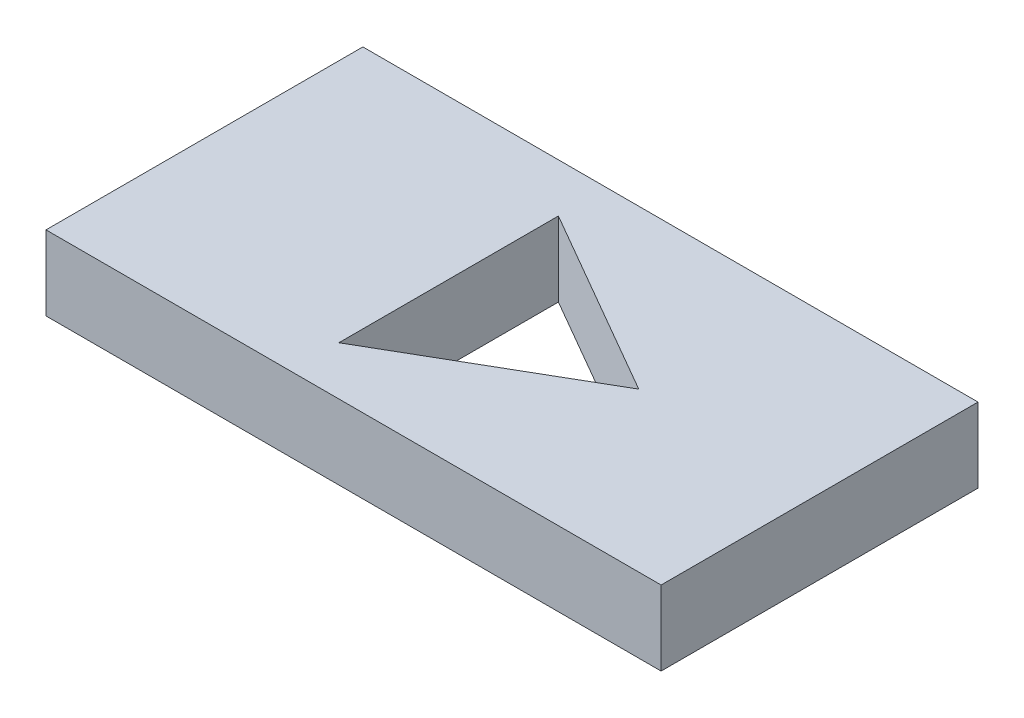
ISO-10303-21;
HEADER;
FILE_DESCRIPTION(('STEP AP214'),'2;1');
FILE_NAME('part.step','',(''),(''),'','','');
FILE_SCHEMA(('AUTOMOTIVE_DESIGN { 1 0 10303 214 1 1 1 1 }'));
ENDSEC;
DATA;
#1=APPLICATION_CONTEXT('core data for automotive mechanical design processes');
#2=APPLICATION_PROTOCOL_DEFINITION('international standard','automotive_design',2000,#1);
#3=PRODUCT_CONTEXT('',#1,'mechanical');
#4=PRODUCT('Part','Part','',(#3));
#5=PRODUCT_RELATED_PRODUCT_CATEGORY('part','',(#4));
#6=PRODUCT_DEFINITION_FORMATION('','',#4);
#7=PRODUCT_DEFINITION_CONTEXT('part definition',#1,'design');
#8=PRODUCT_DEFINITION('design','',#6,#7);
#9=PRODUCT_DEFINITION_SHAPE('','',#8);
#10=(LENGTH_UNIT() NAMED_UNIT(*) SI_UNIT(.MILLI.,.METRE.));
#11=(NAMED_UNIT(*) PLANE_ANGLE_UNIT() SI_UNIT($,.RADIAN.));
#12=(NAMED_UNIT(*) SI_UNIT($,.STERADIAN.) SOLID_ANGLE_UNIT());
#13=UNCERTAINTY_MEASURE_WITH_UNIT(LENGTH_MEASURE(1.E-05),#10,'distance_accuracy_value','');
#14=(GEOMETRIC_REPRESENTATION_CONTEXT(3) GLOBAL_UNCERTAINTY_ASSIGNED_CONTEXT((#13)) GLOBAL_UNIT_ASSIGNED_CONTEXT((#10,
#11,#12)) REPRESENTATION_CONTEXT('',''));
#15=CARTESIAN_POINT('',(0.,0.,0.));
#16=DIRECTION('',(0.,0.,1.));
#17=DIRECTION('',(1.,0.,0.));
#18=AXIS2_PLACEMENT_3D('',#15,#16,#17);
#19=CARTESIAN_POINT('',(0.,25.4,0.));
#20=DIRECTION('',(0.,1.,0.));
#21=DIRECTION('',(0.,0.,1.));
#22=AXIS2_PLACEMENT_3D('',#19,#20,#21);
#23=PLANE('',#22);
#24=DIRECTION('',(1.,0.,0.));
#25=VECTOR('',#24,1.);
#26=CARTESIAN_POINT('',(-104.775,25.4,53.975));
#27=LINE('',#26,#25);
#28=CARTESIAN_POINT('',(-104.775,25.4,53.975));
#29=VERTEX_POINT('',#28);
#30=CARTESIAN_POINT('',(104.775,25.4,53.975));
#31=VERTEX_POINT('',#30);
#32=EDGE_CURVE('E118',#29,#31,#27,.T.);
#33=ORIENTED_EDGE('',*,*,#32,.T.);
#34=DIRECTION('',(0.,0.,-1.));
#35=VECTOR('',#34,1.);
#36=CARTESIAN_POINT('',(104.775,25.4,53.975));
#37=LINE('',#36,#35);
#38=CARTESIAN_POINT('',(104.775,25.4,-53.975));
#39=VERTEX_POINT('',#38);
#40=EDGE_CURVE('E121',#31,#39,#37,.T.);
#41=ORIENTED_EDGE('',*,*,#40,.T.);
#42=DIRECTION('',(-1.,0.,0.));
#43=VECTOR('',#42,1.);
#44=CARTESIAN_POINT('',(104.775,25.4,-53.975));
#45=LINE('',#44,#43);
#46=CARTESIAN_POINT('',(-104.775,25.4,-53.975));
#47=VERTEX_POINT('',#46);
#48=EDGE_CURVE('E124',#39,#47,#45,.T.);
#49=ORIENTED_EDGE('',*,*,#48,.T.);
#50=DIRECTION('',(0.,0.,1.));
#51=VECTOR('',#50,1.);
#52=CARTESIAN_POINT('',(-104.775,25.4,-53.975));
#53=LINE('',#52,#51);
#54=EDGE_CURVE('E126',#47,#29,#53,.T.);
#55=ORIENTED_EDGE('',*,*,#54,.T.);
#56=EDGE_LOOP('',(#33,#41,#49,#55));
#57=FACE_BOUND('',#56,.T.);
#58=DIRECTION('',(0.,0.,1.));
#59=VECTOR('',#58,1.);
#60=CARTESIAN_POINT('',(-21.59,25.4,-37.3949769354121));
#61=LINE('',#60,#59);
#62=CARTESIAN_POINT('',(-21.59,25.4,-37.3949769354121));
#63=VERTEX_POINT('',#62);
#64=CARTESIAN_POINT('',(-21.59,25.4,37.3949769354121));
#65=VERTEX_POINT('',#64);
#66=EDGE_CURVE('E99',#63,#65,#61,.T.);
#67=ORIENTED_EDGE('',*,*,#66,.F.);
#68=DIRECTION('',(-0.866025403784439,0.,-0.5));
#69=VECTOR('',#68,1.);
#70=CARTESIAN_POINT('',(43.18,25.4,0.));
#71=LINE('',#70,#69);
#72=CARTESIAN_POINT('',(43.18,25.4,0.));
#73=VERTEX_POINT('',#72);
#74=EDGE_CURVE('E91',#73,#63,#71,.T.);
#75=ORIENTED_EDGE('',*,*,#74,.F.);
#76=DIRECTION('',(0.866025403784439,0.,-0.5));
#77=VECTOR('',#76,1.);
#78=CARTESIAN_POINT('',(-21.59,25.4,37.3949769354121));
#79=LINE('',#78,#77);
#80=EDGE_CURVE('E108',#65,#73,#79,.T.);
#81=ORIENTED_EDGE('',*,*,#80,.F.);
#82=EDGE_LOOP('',(#67,#75,#81));
#83=FACE_BOUND('',#82,.T.);
#84=ADVANCED_FACE('F32',(#57,#83),#23,.T.);
#85=CARTESIAN_POINT('',(0.,0.,0.));
#86=DIRECTION('',(0.,1.,0.));
#87=DIRECTION('',(0.,0.,1.));
#88=AXIS2_PLACEMENT_3D('',#85,#86,#87);
#89=PLANE('',#88);
#90=DIRECTION('',(1.,0.,0.));
#91=VECTOR('',#90,1.);
#92=CARTESIAN_POINT('',(-104.775,0.,53.975));
#93=LINE('',#92,#91);
#94=CARTESIAN_POINT('',(-104.775,0.,53.975));
#95=VERTEX_POINT('',#94);
#96=CARTESIAN_POINT('',(104.775,0.,53.975));
#97=VERTEX_POINT('',#96);
#98=EDGE_CURVE('E106',#95,#97,#93,.T.);
#99=ORIENTED_EDGE('',*,*,#98,.F.);
#100=DIRECTION('',(0.,0.,1.));
#101=VECTOR('',#100,1.);
#102=CARTESIAN_POINT('',(-104.775,0.,-53.975));
#103=LINE('',#102,#101);
#104=CARTESIAN_POINT('',(-104.775,0.,-53.975));
#105=VERTEX_POINT('',#104);
#106=EDGE_CURVE('E122',#105,#95,#103,.T.);
#107=ORIENTED_EDGE('',*,*,#106,.F.);
#108=DIRECTION('',(-1.,0.,0.));
#109=VECTOR('',#108,1.);
#110=CARTESIAN_POINT('',(104.775,0.,-53.975));
#111=LINE('',#110,#109);
#112=CARTESIAN_POINT('',(104.775,0.,-53.975));
#113=VERTEX_POINT('',#112);
#114=EDGE_CURVE('E133',#113,#105,#111,.T.);
#115=ORIENTED_EDGE('',*,*,#114,.F.);
#116=DIRECTION('',(0.,0.,-1.));
#117=VECTOR('',#116,1.);
#118=CARTESIAN_POINT('',(104.775,0.,53.975));
#119=LINE('',#118,#117);
#120=EDGE_CURVE('E131',#97,#113,#119,.T.);
#121=ORIENTED_EDGE('',*,*,#120,.F.);
#122=EDGE_LOOP('',(#99,#107,#115,#121));
#123=FACE_BOUND('',#122,.T.);
#124=DIRECTION('',(-0.866025403784439,0.,-0.5));
#125=VECTOR('',#124,1.);
#126=CARTESIAN_POINT('',(43.18,0.,0.));
#127=LINE('',#126,#125);
#128=CARTESIAN_POINT('',(43.18,0.,0.));
#129=VERTEX_POINT('',#128);
#130=CARTESIAN_POINT('',(-21.59,0.,-37.3949769354121));
#131=VERTEX_POINT('',#130);
#132=EDGE_CURVE('E55',#129,#131,#127,.T.);
#133=ORIENTED_EDGE('',*,*,#132,.T.);
#134=DIRECTION('',(0.,0.,1.));
#135=VECTOR('',#134,1.);
#136=CARTESIAN_POINT('',(-21.59,0.,-37.3949769354121));
#137=LINE('',#136,#135);
#138=CARTESIAN_POINT('',(-21.59,0.,37.3949769354121));
#139=VERTEX_POINT('',#138);
#140=EDGE_CURVE('E105',#131,#139,#137,.T.);
#141=ORIENTED_EDGE('',*,*,#140,.T.);
#142=DIRECTION('',(0.866025403784439,0.,-0.5));
#143=VECTOR('',#142,1.);
#144=CARTESIAN_POINT('',(-21.59,0.,37.3949769354121));
#145=LINE('',#144,#143);
#146=EDGE_CURVE('E100',#139,#129,#145,.T.);
#147=ORIENTED_EDGE('',*,*,#146,.T.);
#148=EDGE_LOOP('',(#133,#141,#147));
#149=FACE_BOUND('',#148,.T.);
#150=ADVANCED_FACE('F151',(#123,#149),#89,.F.);
#151=CARTESIAN_POINT('',(-104.775,25.4,53.975));
#152=DIRECTION('',(0.,0.,-1.));
#153=DIRECTION('',(-1.,0.,0.));
#154=AXIS2_PLACEMENT_3D('',#151,#152,#153);
#155=PLANE('',#154);
#156=ORIENTED_EDGE('',*,*,#98,.T.);
#157=DIRECTION('',(0.,-1.,0.));
#158=VECTOR('',#157,1.);
#159=CARTESIAN_POINT('',(104.775,25.4,53.975));
#160=LINE('',#159,#158);
#161=EDGE_CURVE('E11',#31,#97,#160,.T.);
#162=ORIENTED_EDGE('',*,*,#161,.F.);
#163=ORIENTED_EDGE('',*,*,#32,.F.);
#164=DIRECTION('',(0.,-1.,0.));
#165=VECTOR('',#164,1.);
#166=CARTESIAN_POINT('',(-104.775,25.4,53.975));
#167=LINE('',#166,#165);
#168=EDGE_CURVE('E128',#29,#95,#167,.T.);
#169=ORIENTED_EDGE('',*,*,#168,.T.);
#170=EDGE_LOOP('',(#156,#162,#163,#169));
#171=FACE_BOUND('',#170,.T.);
#172=ADVANCED_FACE('F34',(#171),#155,.F.);
#173=CARTESIAN_POINT('',(104.775,25.4,53.975));
#174=DIRECTION('',(-1.,0.,0.));
#175=DIRECTION('',(0.,0.,1.));
#176=AXIS2_PLACEMENT_3D('',#173,#174,#175);
#177=PLANE('',#176);
#178=ORIENTED_EDGE('',*,*,#120,.T.);
#179=DIRECTION('',(0.,-1.,0.));
#180=VECTOR('',#179,1.);
#181=CARTESIAN_POINT('',(104.775,25.4,-53.975));
#182=LINE('',#181,#180);
#183=EDGE_CURVE('E40',#39,#113,#182,.T.);
#184=ORIENTED_EDGE('',*,*,#183,.F.);
#185=ORIENTED_EDGE('',*,*,#40,.F.);
#186=ORIENTED_EDGE('',*,*,#161,.T.);
#187=EDGE_LOOP('',(#178,#184,#185,#186));
#188=FACE_BOUND('',#187,.T.);
#189=ADVANCED_FACE('F161',(#188),#177,.F.);
#190=CARTESIAN_POINT('',(104.775,25.4,-53.975));
#191=DIRECTION('',(0.,0.,1.));
#192=DIRECTION('',(1.,0.,0.));
#193=AXIS2_PLACEMENT_3D('',#190,#191,#192);
#194=PLANE('',#193);
#195=ORIENTED_EDGE('',*,*,#114,.T.);
#196=DIRECTION('',(0.,-1.,0.));
#197=VECTOR('',#196,1.);
#198=CARTESIAN_POINT('',(-104.775,25.4,-53.975));
#199=LINE('',#198,#197);
#200=EDGE_CURVE('E138',#47,#105,#199,.T.);
#201=ORIENTED_EDGE('',*,*,#200,.F.);
#202=ORIENTED_EDGE('',*,*,#48,.F.);
#203=ORIENTED_EDGE('',*,*,#183,.T.);
#204=EDGE_LOOP('',(#195,#201,#202,#203));
#205=FACE_BOUND('',#204,.T.);
#206=ADVANCED_FACE('F145',(#205),#194,.F.);
#207=CARTESIAN_POINT('',(-104.775,25.4,-53.975));
#208=DIRECTION('',(1.,0.,0.));
#209=DIRECTION('',(0.,0.,-1.));
#210=AXIS2_PLACEMENT_3D('',#207,#208,#209);
#211=PLANE('',#210);
#212=ORIENTED_EDGE('',*,*,#106,.T.);
#213=ORIENTED_EDGE('',*,*,#168,.F.);
#214=ORIENTED_EDGE('',*,*,#54,.F.);
#215=ORIENTED_EDGE('',*,*,#200,.T.);
#216=EDGE_LOOP('',(#212,#213,#214,#215));
#217=FACE_BOUND('',#216,.T.);
#218=ADVANCED_FACE('F155',(#217),#211,.F.);
#219=CARTESIAN_POINT('',(43.18,25.4,0.));
#220=DIRECTION('',(-0.5,0.,0.866025403784439));
#221=DIRECTION('',(0.866025403784439,0.,0.5));
#222=AXIS2_PLACEMENT_3D('',#219,#220,#221);
#223=PLANE('',#222);
#224=ORIENTED_EDGE('',*,*,#132,.F.);
#225=DIRECTION('',(0.,-1.,0.));
#226=VECTOR('',#225,1.);
#227=CARTESIAN_POINT('',(43.18,25.4,0.));
#228=LINE('',#227,#226);
#229=EDGE_CURVE('E95',#73,#129,#228,.T.);
#230=ORIENTED_EDGE('',*,*,#229,.F.);
#231=ORIENTED_EDGE('',*,*,#74,.T.);
#232=DIRECTION('',(0.,-1.,0.));
#233=VECTOR('',#232,1.);
#234=CARTESIAN_POINT('',(-21.59,25.4,-37.3949769354121));
#235=LINE('',#234,#233);
#236=EDGE_CURVE('E94',#63,#131,#235,.T.);
#237=ORIENTED_EDGE('',*,*,#236,.T.);
#238=EDGE_LOOP('',(#224,#230,#231,#237));
#239=FACE_BOUND('',#238,.T.);
#240=ADVANCED_FACE('F93',(#239),#223,.T.);
#241=CARTESIAN_POINT('',(-21.59,25.4,-37.3949769354121));
#242=DIRECTION('',(1.,0.,0.));
#243=DIRECTION('',(0.,0.,-1.));
#244=AXIS2_PLACEMENT_3D('',#241,#242,#243);
#245=PLANE('',#244);
#246=ORIENTED_EDGE('',*,*,#140,.F.);
#247=ORIENTED_EDGE('',*,*,#236,.F.);
#248=ORIENTED_EDGE('',*,*,#66,.T.);
#249=DIRECTION('',(0.,-1.,0.));
#250=VECTOR('',#249,1.);
#251=CARTESIAN_POINT('',(-21.59,25.4,37.3949769354121));
#252=LINE('',#251,#250);
#253=EDGE_CURVE('E47',#65,#139,#252,.T.);
#254=ORIENTED_EDGE('',*,*,#253,.T.);
#255=EDGE_LOOP('',(#246,#247,#248,#254));
#256=FACE_BOUND('',#255,.T.);
#257=ADVANCED_FACE('F103',(#256),#245,.T.);
#258=CARTESIAN_POINT('',(-21.59,25.4,37.3949769354121));
#259=DIRECTION('',(-0.5,0.,-0.866025403784439));
#260=DIRECTION('',(-0.866025403784439,0.,0.5));
#261=AXIS2_PLACEMENT_3D('',#258,#259,#260);
#262=PLANE('',#261);
#263=ORIENTED_EDGE('',*,*,#146,.F.);
#264=ORIENTED_EDGE('',*,*,#253,.F.);
#265=ORIENTED_EDGE('',*,*,#80,.T.);
#266=ORIENTED_EDGE('',*,*,#229,.T.);
#267=EDGE_LOOP('',(#263,#264,#265,#266));
#268=FACE_BOUND('',#267,.T.);
#269=ADVANCED_FACE('F184',(#268),#262,.T.);
#270=CLOSED_SHELL('',(#84,#150,#172,#189,#206,#218,#240,#257,#269));
#271=MANIFOLD_SOLID_BREP('B2',#270);
#272=ADVANCED_BREP_SHAPE_REPRESENTATION('',(#18,#271),#14);
#273=SHAPE_DEFINITION_REPRESENTATION(#9,#272);
ENDSEC;
END-ISO-10303-21;
